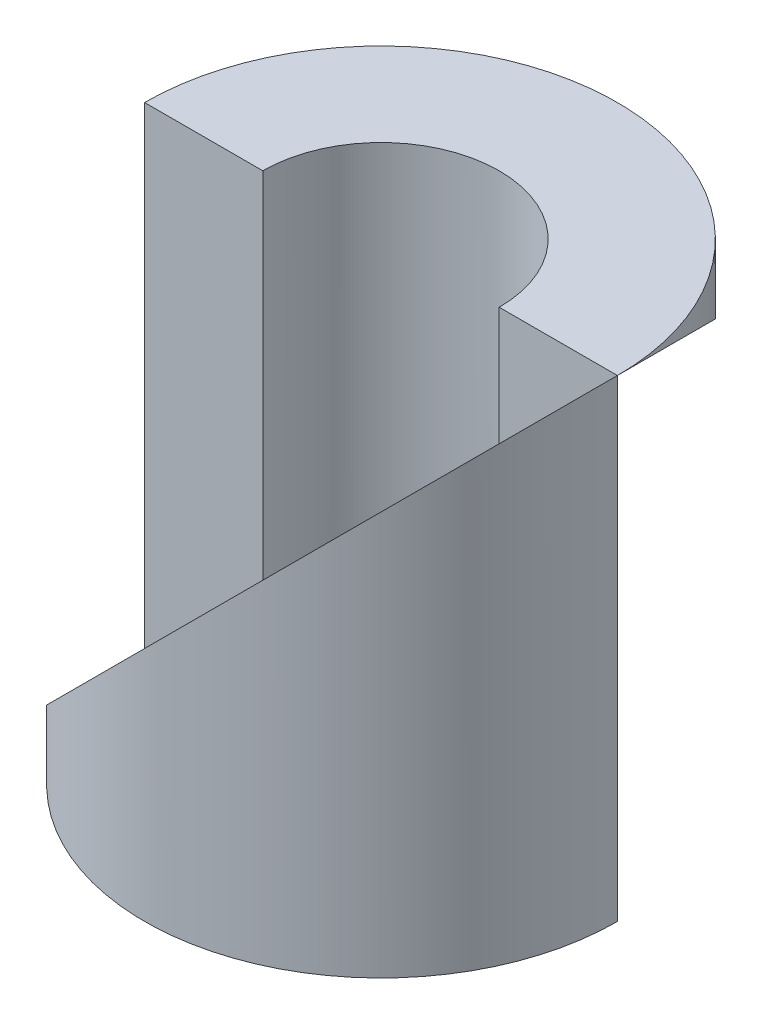
ISO-10303-21;
HEADER;
FILE_DESCRIPTION(('STEP AP214'),'2;1');
FILE_NAME('part.step','',(''),(''),'','','');
FILE_SCHEMA(('AUTOMOTIVE_DESIGN { 1 0 10303 214 1 1 1 1 }'));
ENDSEC;
DATA;
#1=APPLICATION_CONTEXT('core data for automotive mechanical design processes');
#2=APPLICATION_PROTOCOL_DEFINITION('international standard','automotive_design',2000,#1);
#3=PRODUCT_CONTEXT('',#1,'mechanical');
#4=PRODUCT('Part','Part','',(#3));
#5=PRODUCT_RELATED_PRODUCT_CATEGORY('part','',(#4));
#6=PRODUCT_DEFINITION_FORMATION('','',#4);
#7=PRODUCT_DEFINITION_CONTEXT('part definition',#1,'design');
#8=PRODUCT_DEFINITION('design','',#6,#7);
#9=PRODUCT_DEFINITION_SHAPE('','',#8);
#10=(LENGTH_UNIT() NAMED_UNIT(*) SI_UNIT(.MILLI.,.METRE.));
#11=(NAMED_UNIT(*) PLANE_ANGLE_UNIT() SI_UNIT($,.RADIAN.));
#12=(NAMED_UNIT(*) SI_UNIT($,.STERADIAN.) SOLID_ANGLE_UNIT());
#13=UNCERTAINTY_MEASURE_WITH_UNIT(LENGTH_MEASURE(1.E-05),#10,'distance_accuracy_value','');
#14=(GEOMETRIC_REPRESENTATION_CONTEXT(3) GLOBAL_UNCERTAINTY_ASSIGNED_CONTEXT((#13)) GLOBAL_UNIT_ASSIGNED_CONTEXT((#10,
#11,#12)) REPRESENTATION_CONTEXT('',''));
#15=CARTESIAN_POINT('',(0.,0.,0.));
#16=DIRECTION('',(0.,0.,1.));
#17=DIRECTION('',(1.,0.,0.));
#18=AXIS2_PLACEMENT_3D('',#15,#16,#17);
#19=CARTESIAN_POINT('',(0.,40.,0.));
#20=DIRECTION('',(0.,-1.,0.));
#21=DIRECTION('',(0.,0.,-1.));
#22=AXIS2_PLACEMENT_3D('',#19,#20,#21);
#23=CYLINDRICAL_SURFACE('',#22,20.);
#24=CARTESIAN_POINT('',(0.,40.,0.));
#25=DIRECTION('',(0.,1.,0.));
#26=DIRECTION('',(0.,0.,1.));
#27=AXIS2_PLACEMENT_3D('',#24,#25,#26);
#28=CIRCLE('',#27,20.);
#29=CARTESIAN_POINT('',(20.,40.,0.));
#30=VERTEX_POINT('',#29);
#31=CARTESIAN_POINT('',(-20.,40.,0.));
#32=VERTEX_POINT('',#31);
#33=EDGE_CURVE('E100',#30,#32,#28,.T.);
#34=ORIENTED_EDGE('',*,*,#33,.F.);
#35=CARTESIAN_POINT('',(0.,20.,0.));
#36=DIRECTION('',(-0.707106781186548,0.707106781186548,0.));
#37=DIRECTION('',(-0.707106781186548,-0.707106781186548,0.));
#38=AXIS2_PLACEMENT_3D('',#35,#36,#37);
#39=ELLIPSE('',#38,28.2842712474619,20.);
#40=CARTESIAN_POINT('',(-20.,0.,0.));
#41=VERTEX_POINT('',#40);
#42=EDGE_CURVE('E58',#30,#41,#39,.T.);
#43=ORIENTED_EDGE('',*,*,#42,.T.);
#44=DIRECTION('',(0.,-1.,0.));
#45=VECTOR('',#44,1.);
#46=CARTESIAN_POINT('',(-20.,40.,0.));
#47=LINE('',#46,#45);
#48=EDGE_CURVE('E97',#32,#41,#47,.T.);
#49=ORIENTED_EDGE('',*,*,#48,.F.);
#50=EDGE_LOOP('',(#34,#43,#49));
#51=FACE_BOUND('',#50,.T.);
#52=ADVANCED_FACE('F43',(#51),#23,.T.);
#53=CARTESIAN_POINT('',(0.,40.,0.));
#54=DIRECTION('',(0.,1.,0.));
#55=DIRECTION('',(0.,0.,1.));
#56=AXIS2_PLACEMENT_3D('',#53,#54,#55);
#57=PLANE('',#56);
#58=DIRECTION('',(-1.,0.,0.));
#59=VECTOR('',#58,1.);
#60=CARTESIAN_POINT('',(20.,40.,0.));
#61=LINE('',#60,#59);
#62=CARTESIAN_POINT('',(10.,40.,0.));
#63=VERTEX_POINT('',#62);
#64=EDGE_CURVE('E84',#30,#63,#61,.T.);
#65=ORIENTED_EDGE('',*,*,#64,.F.);
#66=ORIENTED_EDGE('',*,*,#33,.T.);
#67=CARTESIAN_POINT('',(-10.,40.,0.));
#68=VERTEX_POINT('',#67);
#69=EDGE_CURVE('E77',#68,#32,#61,.T.);
#70=ORIENTED_EDGE('',*,*,#69,.F.);
#71=CARTESIAN_POINT('',(0.,40.,0.));
#72=DIRECTION('',(0.,1.,0.));
#73=DIRECTION('',(0.,0.,1.));
#74=AXIS2_PLACEMENT_3D('',#71,#72,#73);
#75=CIRCLE('',#74,10.);
#76=EDGE_CURVE('E91',#63,#68,#75,.T.);
#77=ORIENTED_EDGE('',*,*,#76,.F.);
#78=EDGE_LOOP('',(#65,#66,#70,#77));
#79=FACE_BOUND('',#78,.T.);
#80=ADVANCED_FACE('F108',(#79),#57,.T.);
#81=CARTESIAN_POINT('',(0.,40.,0.));
#82=DIRECTION('',(0.,-1.,0.));
#83=DIRECTION('',(0.,0.,-1.));
#84=AXIS2_PLACEMENT_3D('',#81,#82,#83);
#85=CYLINDRICAL_SURFACE('',#84,10.);
#86=CARTESIAN_POINT('',(0.,20.,0.));
#87=DIRECTION('',(-0.707106781186548,0.707106781186548,0.));
#88=DIRECTION('',(-0.707106781186548,-0.707106781186548,0.));
#89=AXIS2_PLACEMENT_3D('',#86,#87,#88);
#90=ELLIPSE('',#89,14.1421356237309,10.);
#91=CARTESIAN_POINT('',(10.,30.,0.));
#92=VERTEX_POINT('',#91);
#93=CARTESIAN_POINT('',(-10.,10.,0.));
#94=VERTEX_POINT('',#93);
#95=EDGE_CURVE('E12',#92,#94,#90,.T.);
#96=ORIENTED_EDGE('',*,*,#95,.F.);
#97=DIRECTION('',(0.,-1.,0.));
#98=VECTOR('',#97,1.);
#99=CARTESIAN_POINT('',(10.,40.,0.));
#100=LINE('',#99,#98);
#101=EDGE_CURVE('E85',#63,#92,#100,.T.);
#102=ORIENTED_EDGE('',*,*,#101,.F.);
#103=ORIENTED_EDGE('',*,*,#76,.T.);
#104=DIRECTION('',(0.,-1.,0.));
#105=VECTOR('',#104,1.);
#106=CARTESIAN_POINT('',(-10.,40.,0.));
#107=LINE('',#106,#105);
#108=EDGE_CURVE('E95',#94,#68,#107,.F.);
#109=ORIENTED_EDGE('',*,*,#108,.F.);
#110=EDGE_LOOP('',(#96,#102,#103,#109));
#111=FACE_BOUND('',#110,.T.);
#112=ADVANCED_FACE('F94',(#111),#85,.F.);
#113=CARTESIAN_POINT('',(0.,0.,0.));
#114=DIRECTION('',(0.,0.,-1.));
#115=DIRECTION('',(-1.,0.,0.));
#116=AXIS2_PLACEMENT_3D('',#113,#114,#115);
#117=PLANE('',#116);
#118=ORIENTED_EDGE('',*,*,#101,.T.);
#119=DIRECTION('',(0.707106781186548,0.707106781186548,0.));
#120=VECTOR('',#119,1.);
#121=CARTESIAN_POINT('',(-20.,0.,0.));
#122=LINE('',#121,#120);
#123=EDGE_CURVE('E46',#92,#30,#122,.T.);
#124=ORIENTED_EDGE('',*,*,#123,.T.);
#125=ORIENTED_EDGE('',*,*,#64,.T.);
#126=EDGE_LOOP('',(#118,#124,#125));
#127=FACE_BOUND('',#126,.T.);
#128=ADVANCED_FACE('F87',(#127),#117,.F.);
#129=ORIENTED_EDGE('',*,*,#108,.T.);
#130=ORIENTED_EDGE('',*,*,#69,.T.);
#131=ORIENTED_EDGE('',*,*,#48,.T.);
#132=EDGE_CURVE('E51',#41,#94,#122,.T.);
#133=ORIENTED_EDGE('',*,*,#132,.T.);
#134=EDGE_LOOP('',(#129,#130,#131,#133));
#135=FACE_BOUND('',#134,.T.);
#136=ADVANCED_FACE('F116',(#135),#117,.F.);
#137=CARTESIAN_POINT('',(20.,40.,-40.));
#138=DIRECTION('',(-0.707106781186548,0.707106781186548,0.));
#139=DIRECTION('',(-0.707106781186548,-0.707106781186548,0.));
#140=AXIS2_PLACEMENT_3D('',#137,#138,#139);
#141=PLANE('',#140);
#142=ORIENTED_EDGE('',*,*,#123,.F.);
#143=ORIENTED_EDGE('',*,*,#95,.T.);
#144=ORIENTED_EDGE('',*,*,#132,.F.);
#145=ORIENTED_EDGE('',*,*,#42,.F.);
#146=EDGE_LOOP('',(#142,#143,#144,#145));
#147=FACE_BOUND('',#146,.T.);
#148=ADVANCED_FACE('F80',(#147),#141,.F.);
#149=CLOSED_SHELL('',(#52,#80,#112,#128,#136,#148));
#150=MANIFOLD_SOLID_BREP('B2',#149);
#151=CARTESIAN_POINT('',(-20.,0.,40.));
#152=DIRECTION('',(-0.707106781186548,0.707106781186548,0.));
#153=DIRECTION('',(-0.707106781186548,-0.707106781186548,0.));
#154=AXIS2_PLACEMENT_3D('',#151,#152,#153);
#155=PLANE('',#154);
#156=CARTESIAN_POINT('',(0.,20.,0.));
#157=DIRECTION('',(-0.707106781186548,0.707106781186548,0.));
#158=DIRECTION('',(-0.707106781186548,-0.707106781186548,0.));
#159=AXIS2_PLACEMENT_3D('',#156,#157,#158);
#160=ELLIPSE('',#159,28.2842712474619,20.);
#161=CARTESIAN_POINT('',(-20.,0.,0.));
#162=VERTEX_POINT('',#161);
#163=CARTESIAN_POINT('',(20.,40.,0.));
#164=VERTEX_POINT('',#163);
#165=EDGE_CURVE('E213',#162,#164,#160,.T.);
#166=ORIENTED_EDGE('',*,*,#165,.T.);
#167=DIRECTION('',(0.707106781186548,0.707106781186548,0.));
#168=VECTOR('',#167,1.);
#169=CARTESIAN_POINT('',(-20.,0.,0.));
#170=LINE('',#169,#168);
#171=CARTESIAN_POINT('',(10.,30.,0.));
#172=VERTEX_POINT('',#171);
#173=EDGE_CURVE('E173',#172,#164,#170,.T.);
#174=ORIENTED_EDGE('',*,*,#173,.F.);
#175=CARTESIAN_POINT('',(0.,20.,0.));
#176=DIRECTION('',(-0.707106781186548,0.707106781186548,0.));
#177=DIRECTION('',(-0.707106781186548,-0.707106781186548,0.));
#178=AXIS2_PLACEMENT_3D('',#175,#176,#177);
#179=ELLIPSE('',#178,14.1421356237309,10.);
#180=CARTESIAN_POINT('',(-10.,10.,0.));
#181=VERTEX_POINT('',#180);
#182=EDGE_CURVE('E41',#181,#172,#179,.T.);
#183=ORIENTED_EDGE('',*,*,#182,.F.);
#184=EDGE_CURVE('E181',#162,#181,#170,.T.);
#185=ORIENTED_EDGE('',*,*,#184,.F.);
#186=EDGE_LOOP('',(#166,#174,#183,#185));
#187=FACE_BOUND('',#186,.T.);
#188=ADVANCED_FACE('F158',(#187),#155,.T.);
#189=CARTESIAN_POINT('',(0.,40.,0.));
#190=DIRECTION('',(0.,-1.,0.));
#191=DIRECTION('',(0.,0.,-1.));
#192=AXIS2_PLACEMENT_3D('',#189,#190,#191);
#193=CYLINDRICAL_SURFACE('',#192,10.);
#194=DIRECTION('',(0.,-1.,0.));
#195=VECTOR('',#194,1.);
#196=CARTESIAN_POINT('',(-10.,40.,0.));
#197=LINE('',#196,#195);
#198=CARTESIAN_POINT('',(-10.,0.,0.));
#199=VERTEX_POINT('',#198);
#200=EDGE_CURVE('E218',#181,#199,#197,.T.);
#201=ORIENTED_EDGE('',*,*,#200,.F.);
#202=ORIENTED_EDGE('',*,*,#182,.T.);
#203=DIRECTION('',(0.,-1.,0.));
#204=VECTOR('',#203,1.);
#205=CARTESIAN_POINT('',(10.,40.,0.));
#206=LINE('',#205,#204);
#207=CARTESIAN_POINT('',(10.,0.,0.));
#208=VERTEX_POINT('',#207);
#209=EDGE_CURVE('E202',#208,#172,#206,.F.);
#210=ORIENTED_EDGE('',*,*,#209,.F.);
#211=CARTESIAN_POINT('',(0.,0.,0.));
#212=DIRECTION('',(0.,1.,0.));
#213=DIRECTION('',(0.,0.,1.));
#214=AXIS2_PLACEMENT_3D('',#211,#212,#213);
#215=CIRCLE('',#214,10.);
#216=EDGE_CURVE('E211',#199,#208,#215,.T.);
#217=ORIENTED_EDGE('',*,*,#216,.F.);
#218=EDGE_LOOP('',(#201,#202,#210,#217));
#219=FACE_BOUND('',#218,.T.);
#220=ADVANCED_FACE('F222',(#219),#193,.F.);
#221=CARTESIAN_POINT('',(0.,0.,0.));
#222=DIRECTION('',(0.,1.,0.));
#223=DIRECTION('',(0.,0.,1.));
#224=AXIS2_PLACEMENT_3D('',#221,#222,#223);
#225=PLANE('',#224);
#226=CARTESIAN_POINT('',(0.,0.,0.));
#227=DIRECTION('',(0.,1.,0.));
#228=DIRECTION('',(0.,0.,1.));
#229=AXIS2_PLACEMENT_3D('',#226,#227,#228);
#230=CIRCLE('',#229,20.);
#231=CARTESIAN_POINT('',(20.,0.,0.));
#232=VERTEX_POINT('',#231);
#233=EDGE_CURVE('E166',#162,#232,#230,.T.);
#234=ORIENTED_EDGE('',*,*,#233,.F.);
#235=DIRECTION('',(1.,0.,0.));
#236=VECTOR('',#235,1.);
#237=CARTESIAN_POINT('',(-20.,0.,0.));
#238=LINE('',#237,#236);
#239=EDGE_CURVE('E203',#162,#199,#238,.T.);
#240=ORIENTED_EDGE('',*,*,#239,.T.);
#241=ORIENTED_EDGE('',*,*,#216,.T.);
#242=EDGE_CURVE('E197',#208,#232,#238,.T.);
#243=ORIENTED_EDGE('',*,*,#242,.T.);
#244=EDGE_LOOP('',(#234,#240,#241,#243));
#245=FACE_BOUND('',#244,.T.);
#246=ADVANCED_FACE('F208',(#245),#225,.F.);
#247=CARTESIAN_POINT('',(0.,40.,0.));
#248=DIRECTION('',(0.,-1.,0.));
#249=DIRECTION('',(0.,0.,-1.));
#250=AXIS2_PLACEMENT_3D('',#247,#248,#249);
#251=CYLINDRICAL_SURFACE('',#250,20.);
#252=ORIENTED_EDGE('',*,*,#233,.T.);
#253=DIRECTION('',(0.,1.,0.));
#254=VECTOR('',#253,1.);
#255=CARTESIAN_POINT('',(20.,0.,0.));
#256=LINE('',#255,#254);
#257=EDGE_CURVE('E194',#232,#164,#256,.T.);
#258=ORIENTED_EDGE('',*,*,#257,.T.);
#259=ORIENTED_EDGE('',*,*,#165,.F.);
#260=EDGE_LOOP('',(#252,#258,#259));
#261=FACE_BOUND('',#260,.T.);
#262=ADVANCED_FACE('F160',(#261),#251,.T.);
#263=CARTESIAN_POINT('',(0.,0.,0.));
#264=DIRECTION('',(0.,0.,1.));
#265=DIRECTION('',(1.,0.,0.));
#266=AXIS2_PLACEMENT_3D('',#263,#264,#265);
#267=PLANE('',#266);
#268=ORIENTED_EDGE('',*,*,#200,.T.);
#269=ORIENTED_EDGE('',*,*,#239,.F.);
#270=ORIENTED_EDGE('',*,*,#184,.T.);
#271=EDGE_LOOP('',(#268,#269,#270));
#272=FACE_BOUND('',#271,.T.);
#273=ADVANCED_FACE('F235',(#272),#267,.F.);
#274=ORIENTED_EDGE('',*,*,#209,.T.);
#275=ORIENTED_EDGE('',*,*,#173,.T.);
#276=ORIENTED_EDGE('',*,*,#257,.F.);
#277=ORIENTED_EDGE('',*,*,#242,.F.);
#278=EDGE_LOOP('',(#274,#275,#276,#277));
#279=FACE_BOUND('',#278,.T.);
#280=ADVANCED_FACE('F196',(#279),#267,.F.);
#281=CLOSED_SHELL('',(#188,#220,#246,#262,#273,#280));
#282=MANIFOLD_SOLID_BREP('B6',#281);
#283=ADVANCED_BREP_SHAPE_REPRESENTATION('',(#18,#150,#282),#14);
#284=SHAPE_DEFINITION_REPRESENTATION(#9,#283);
ENDSEC;
END-ISO-10303-21;
